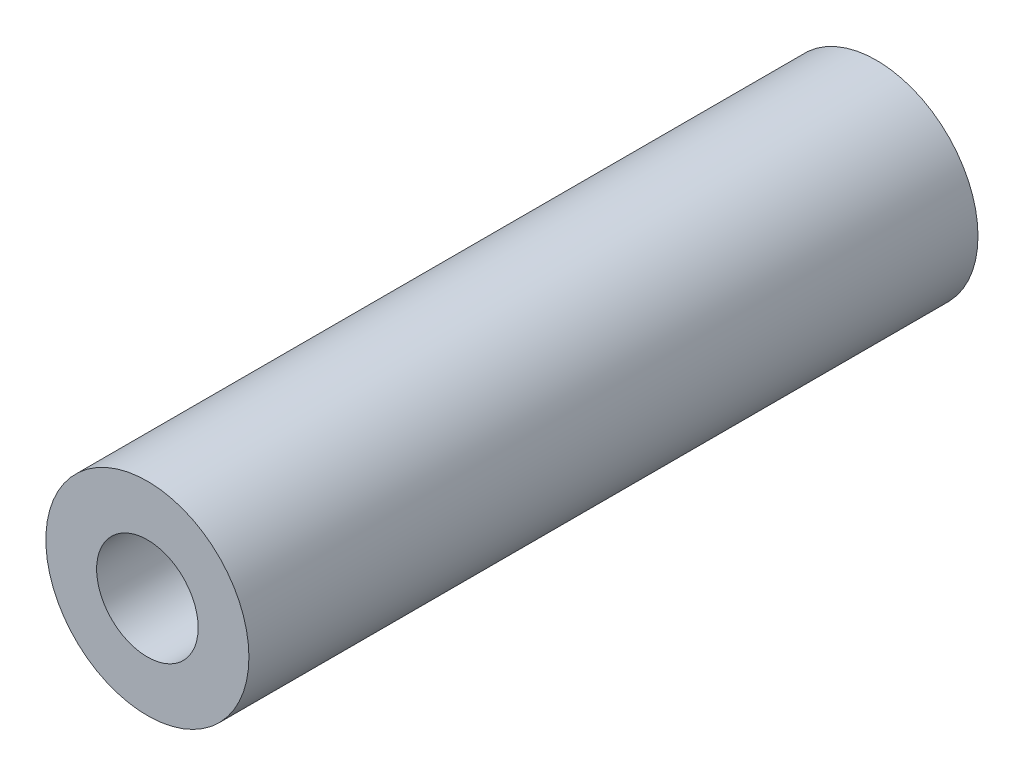
ISO-10303-21;
HEADER;
FILE_DESCRIPTION(('STEP AP214'),'2;1');
FILE_NAME('part.step','',(''),(''),'','','');
FILE_SCHEMA(('AUTOMOTIVE_DESIGN { 1 0 10303 214 1 1 1 1 }'));
ENDSEC;
DATA;
#1=APPLICATION_CONTEXT('core data for automotive mechanical design processes');
#2=APPLICATION_PROTOCOL_DEFINITION('international standard','automotive_design',2000,#1);
#3=PRODUCT_CONTEXT('',#1,'mechanical');
#4=PRODUCT('Part','Part','',(#3));
#5=PRODUCT_RELATED_PRODUCT_CATEGORY('part','',(#4));
#6=PRODUCT_DEFINITION_FORMATION('','',#4);
#7=PRODUCT_DEFINITION_CONTEXT('part definition',#1,'design');
#8=PRODUCT_DEFINITION('design','',#6,#7);
#9=PRODUCT_DEFINITION_SHAPE('','',#8);
#10=(LENGTH_UNIT() NAMED_UNIT(*) SI_UNIT(.MILLI.,.METRE.));
#11=(NAMED_UNIT(*) PLANE_ANGLE_UNIT() SI_UNIT($,.RADIAN.));
#12=(NAMED_UNIT(*) SI_UNIT($,.STERADIAN.) SOLID_ANGLE_UNIT());
#13=UNCERTAINTY_MEASURE_WITH_UNIT(LENGTH_MEASURE(1.E-05),#10,'distance_accuracy_value','');
#14=(GEOMETRIC_REPRESENTATION_CONTEXT(3) GLOBAL_UNCERTAINTY_ASSIGNED_CONTEXT((#13)) GLOBAL_UNIT_ASSIGNED_CONTEXT((#10,
#11,#12)) REPRESENTATION_CONTEXT('',''));
#15=CARTESIAN_POINT('',(0.,0.,0.));
#16=DIRECTION('',(0.,0.,1.));
#17=DIRECTION('',(1.,0.,0.));
#18=AXIS2_PLACEMENT_3D('',#15,#16,#17);
#19=CARTESIAN_POINT('',(0.,0.,35.9));
#20=DIRECTION('',(0.,0.,-1.));
#21=DIRECTION('',(-1.,0.,0.));
#22=AXIS2_PLACEMENT_3D('',#19,#20,#21);
#23=CYLINDRICAL_SURFACE('',#22,5.);
#24=CARTESIAN_POINT('',(0.,0.,35.9));
#25=DIRECTION('',(0.,0.,1.));
#26=DIRECTION('',(1.,0.,0.));
#27=AXIS2_PLACEMENT_3D('',#24,#25,#26);
#28=CIRCLE('',#27,5.);
#29=CARTESIAN_POINT('',(5.,0.,35.9));
#30=VERTEX_POINT('',#29);
#31=EDGE_CURVE('E10',#30,#30,#28,.T.);
#32=ORIENTED_EDGE('',*,*,#31,.F.);
#33=EDGE_LOOP('',(#32));
#34=FACE_BOUND('',#33,.T.);
#35=CARTESIAN_POINT('',(0.,0.,0.));
#36=DIRECTION('',(0.,0.,1.));
#37=DIRECTION('',(1.,0.,0.));
#38=AXIS2_PLACEMENT_3D('',#35,#36,#37);
#39=CIRCLE('',#38,5.);
#40=CARTESIAN_POINT('',(5.,0.,0.));
#41=VERTEX_POINT('',#40);
#42=EDGE_CURVE('E38',#41,#41,#39,.T.);
#43=ORIENTED_EDGE('',*,*,#42,.T.);
#44=EDGE_LOOP('',(#43));
#45=FACE_BOUND('',#44,.T.);
#46=ADVANCED_FACE('F35',(#34,#45),#23,.T.);
#47=CARTESIAN_POINT('',(0.,0.,35.9));
#48=DIRECTION('',(0.,0.,1.));
#49=DIRECTION('',(1.,0.,0.));
#50=AXIS2_PLACEMENT_3D('',#47,#48,#49);
#51=PLANE('',#50);
#52=CARTESIAN_POINT('',(0.,0.,35.9));
#53=DIRECTION('',(0.,0.,1.));
#54=DIRECTION('',(1.,0.,0.));
#55=AXIS2_PLACEMENT_3D('',#52,#53,#54);
#56=CIRCLE('',#55,2.5);
#57=CARTESIAN_POINT('',(2.5,0.,35.9));
#58=VERTEX_POINT('',#57);
#59=EDGE_CURVE('E49',#58,#58,#56,.T.);
#60=ORIENTED_EDGE('',*,*,#59,.F.);
#61=EDGE_LOOP('',(#60));
#62=FACE_BOUND('',#61,.T.);
#63=ORIENTED_EDGE('',*,*,#31,.T.);
#64=EDGE_LOOP('',(#63));
#65=FACE_BOUND('',#64,.T.);
#66=ADVANCED_FACE('F55',(#62,#65),#51,.T.);
#67=CARTESIAN_POINT('',(0.,0.,0.));
#68=DIRECTION('',(0.,0.,1.));
#69=DIRECTION('',(1.,0.,0.));
#70=AXIS2_PLACEMENT_3D('',#67,#68,#69);
#71=PLANE('',#70);
#72=CARTESIAN_POINT('',(0.,0.,0.));
#73=DIRECTION('',(0.,0.,1.));
#74=DIRECTION('',(1.,0.,0.));
#75=AXIS2_PLACEMENT_3D('',#72,#73,#74);
#76=CIRCLE('',#75,2.5);
#77=CARTESIAN_POINT('',(2.5,0.,0.));
#78=VERTEX_POINT('',#77);
#79=EDGE_CURVE('E45',#78,#78,#76,.T.);
#80=ORIENTED_EDGE('',*,*,#79,.T.);
#81=EDGE_LOOP('',(#80));
#82=FACE_BOUND('',#81,.T.);
#83=ORIENTED_EDGE('',*,*,#42,.F.);
#84=EDGE_LOOP('',(#83));
#85=FACE_BOUND('',#84,.T.);
#86=ADVANCED_FACE('F57',(#82,#85),#71,.F.);
#87=CARTESIAN_POINT('',(0.,0.,35.9));
#88=DIRECTION('',(0.,0.,1.));
#89=DIRECTION('',(1.,0.,0.));
#90=AXIS2_PLACEMENT_3D('',#87,#88,#89);
#91=CYLINDRICAL_SURFACE('',#90,2.5);
#92=ORIENTED_EDGE('',*,*,#79,.F.);
#93=EDGE_LOOP('',(#92));
#94=FACE_BOUND('',#93,.T.);
#95=ORIENTED_EDGE('',*,*,#59,.T.);
#96=EDGE_LOOP('',(#95));
#97=FACE_BOUND('',#96,.T.);
#98=ADVANCED_FACE('F53',(#94,#97),#91,.F.);
#99=CLOSED_SHELL('',(#46,#66,#86,#98));
#100=MANIFOLD_SOLID_BREP('B2',#99);
#101=ADVANCED_BREP_SHAPE_REPRESENTATION('',(#18,#100),#14);
#102=SHAPE_DEFINITION_REPRESENTATION(#9,#101);
ENDSEC;
END-ISO-10303-21;
